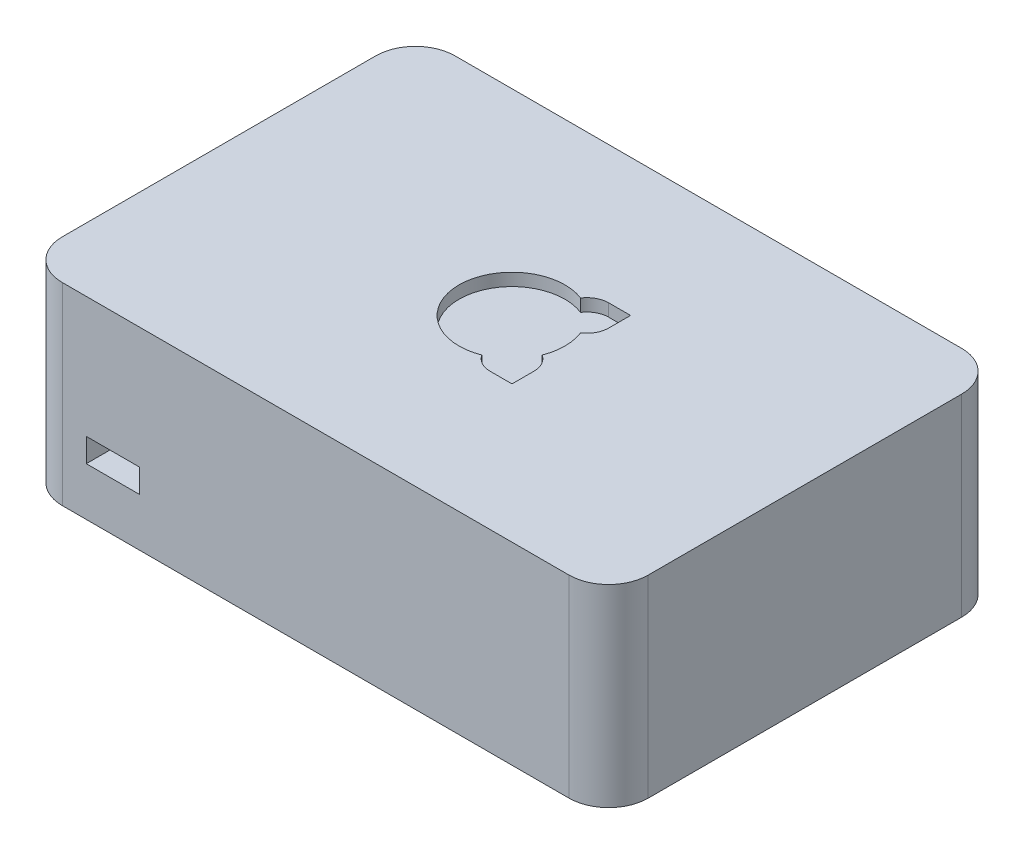
ISO-10303-21;
HEADER;
FILE_DESCRIPTION(('STEP AP214'),'2;1');
FILE_NAME('part.step','',(''),(''),'','','');
FILE_SCHEMA(('AUTOMOTIVE_DESIGN { 1 0 10303 214 1 1 1 1 }'));
ENDSEC;
DATA;
#1=APPLICATION_CONTEXT('core data for automotive mechanical design processes');
#2=APPLICATION_PROTOCOL_DEFINITION('international standard','automotive_design',2000,#1);
#3=PRODUCT_CONTEXT('',#1,'mechanical');
#4=PRODUCT('Part','Part','',(#3));
#5=PRODUCT_RELATED_PRODUCT_CATEGORY('part','',(#4));
#6=PRODUCT_DEFINITION_FORMATION('','',#4);
#7=PRODUCT_DEFINITION_CONTEXT('part definition',#1,'design');
#8=PRODUCT_DEFINITION('design','',#6,#7);
#9=PRODUCT_DEFINITION_SHAPE('','',#8);
#10=(LENGTH_UNIT() NAMED_UNIT(*) SI_UNIT(.MILLI.,.METRE.));
#11=(NAMED_UNIT(*) PLANE_ANGLE_UNIT() SI_UNIT($,.RADIAN.));
#12=(NAMED_UNIT(*) SI_UNIT($,.STERADIAN.) SOLID_ANGLE_UNIT());
#13=UNCERTAINTY_MEASURE_WITH_UNIT(LENGTH_MEASURE(1.E-05),#10,'distance_accuracy_value','');
#14=(GEOMETRIC_REPRESENTATION_CONTEXT(3) GLOBAL_UNCERTAINTY_ASSIGNED_CONTEXT((#13)) GLOBAL_UNIT_ASSIGNED_CONTEXT((#10,
#11,#12)) REPRESENTATION_CONTEXT('',''));
#15=CARTESIAN_POINT('',(0.,0.,0.));
#16=DIRECTION('',(0.,0.,1.));
#17=DIRECTION('',(1.,0.,0.));
#18=AXIS2_PLACEMENT_3D('',#15,#16,#17);
#19=CARTESIAN_POINT('',(0.,31.,-63.));
#20=DIRECTION('',(0.,0.,-1.));
#21=DIRECTION('',(-1.,0.,0.));
#22=AXIS2_PLACEMENT_3D('',#19,#20,#21);
#23=PLANE('',#22);
#24=DIRECTION('',(1.,0.,0.));
#25=VECTOR('',#24,1.);
#26=CARTESIAN_POINT('',(0.,0.,-63.));
#27=LINE('',#26,#25);
#28=CARTESIAN_POINT('',(6.35,0.,-63.));
#29=VERTEX_POINT('',#28);
#30=CARTESIAN_POINT('',(87.65,0.,-63.));
#31=VERTEX_POINT('',#30);
#32=EDGE_CURVE('E424',#29,#31,#27,.T.);
#33=ORIENTED_EDGE('',*,*,#32,.F.);
#34=DIRECTION('',(0.,-1.,0.));
#35=VECTOR('',#34,1.);
#36=CARTESIAN_POINT('',(6.35,31.,-63.));
#37=LINE('',#36,#35);
#38=CARTESIAN_POINT('',(6.35,31.,-63.));
#39=VERTEX_POINT('',#38);
#40=EDGE_CURVE('E444',#29,#39,#37,.F.);
#41=ORIENTED_EDGE('',*,*,#40,.T.);
#42=DIRECTION('',(1.,0.,0.));
#43=VECTOR('',#42,1.);
#44=CARTESIAN_POINT('',(0.,31.,-63.));
#45=LINE('',#44,#43);
#46=CARTESIAN_POINT('',(87.65,31.,-63.));
#47=VERTEX_POINT('',#46);
#48=EDGE_CURVE('E412',#39,#47,#45,.T.);
#49=ORIENTED_EDGE('',*,*,#48,.T.);
#50=DIRECTION('',(0.,-1.,0.));
#51=VECTOR('',#50,1.);
#52=CARTESIAN_POINT('',(87.65,0.,-63.));
#53=LINE('',#52,#51);
#54=EDGE_CURVE('E441',#47,#31,#53,.T.);
#55=ORIENTED_EDGE('',*,*,#54,.T.);
#56=EDGE_LOOP('',(#33,#41,#49,#55));
#57=FACE_BOUND('',#56,.T.);
#58=DIRECTION('',(1.,0.,0.));
#59=VECTOR('',#58,1.);
#60=CARTESIAN_POINT('',(12.,28.46,-63.));
#61=LINE('',#60,#59);
#62=CARTESIAN_POINT('',(12.,28.46,-63.));
#63=VERTEX_POINT('',#62);
#64=CARTESIAN_POINT('',(62.5,28.46,-63.));
#65=VERTEX_POINT('',#64);
#66=EDGE_CURVE('E389',#63,#65,#61,.T.);
#67=ORIENTED_EDGE('',*,*,#66,.F.);
#68=DIRECTION('',(0.,1.,0.));
#69=VECTOR('',#68,1.);
#70=CARTESIAN_POINT('',(12.,26.46,-63.));
#71=LINE('',#70,#69);
#72=CARTESIAN_POINT('',(12.,26.46,-63.));
#73=VERTEX_POINT('',#72);
#74=EDGE_CURVE('E370',#73,#63,#71,.T.);
#75=ORIENTED_EDGE('',*,*,#74,.F.);
#76=DIRECTION('',(-1.,0.,0.));
#77=VECTOR('',#76,1.);
#78=CARTESIAN_POINT('',(12.,26.46,-63.));
#79=LINE('',#78,#77);
#80=CARTESIAN_POINT('',(62.5,26.46,-63.));
#81=VERTEX_POINT('',#80);
#82=EDGE_CURVE('E380',#81,#73,#79,.T.);
#83=ORIENTED_EDGE('',*,*,#82,.F.);
#84=DIRECTION('',(0.,-1.,0.));
#85=VECTOR('',#84,1.);
#86=CARTESIAN_POINT('',(62.5,26.46,-63.));
#87=LINE('',#86,#85);
#88=EDGE_CURVE('E391',#65,#81,#87,.T.);
#89=ORIENTED_EDGE('',*,*,#88,.F.);
#90=EDGE_LOOP('',(#67,#75,#83,#89));
#91=FACE_BOUND('',#90,.T.);
#92=ADVANCED_FACE('F92',(#57,#91),#23,.T.);
#93=CARTESIAN_POINT('',(0.,31.,0.));
#94=DIRECTION('',(0.,0.,-1.));
#95=DIRECTION('',(-1.,0.,0.));
#96=AXIS2_PLACEMENT_3D('',#93,#94,#95);
#97=PLANE('',#96);
#98=DIRECTION('',(1.,0.,0.));
#99=VECTOR('',#98,1.);
#100=CARTESIAN_POINT('',(10.2,7.75,0.));
#101=LINE('',#100,#99);
#102=CARTESIAN_POINT('',(10.2,7.75,0.));
#103=VERTEX_POINT('',#102);
#104=CARTESIAN_POINT('',(18.7,7.75,0.));
#105=VERTEX_POINT('',#104);
#106=EDGE_CURVE('E360',#103,#105,#101,.T.);
#107=ORIENTED_EDGE('',*,*,#106,.F.);
#108=DIRECTION('',(0.,-1.,0.));
#109=VECTOR('',#108,1.);
#110=CARTESIAN_POINT('',(10.2,7.75,0.));
#111=LINE('',#110,#109);
#112=CARTESIAN_POINT('',(10.2,11.55,0.));
#113=VERTEX_POINT('',#112);
#114=EDGE_CURVE('E115',#113,#103,#111,.T.);
#115=ORIENTED_EDGE('',*,*,#114,.F.);
#116=DIRECTION('',(-1.,0.,0.));
#117=VECTOR('',#116,1.);
#118=CARTESIAN_POINT('',(10.2,11.55,0.));
#119=LINE('',#118,#117);
#120=CARTESIAN_POINT('',(18.7,11.55,0.));
#121=VERTEX_POINT('',#120);
#122=EDGE_CURVE('E349',#121,#113,#119,.T.);
#123=ORIENTED_EDGE('',*,*,#122,.F.);
#124=DIRECTION('',(0.,1.,0.));
#125=VECTOR('',#124,1.);
#126=CARTESIAN_POINT('',(18.7,7.75,0.));
#127=LINE('',#126,#125);
#128=EDGE_CURVE('E363',#105,#121,#127,.T.);
#129=ORIENTED_EDGE('',*,*,#128,.F.);
#130=EDGE_LOOP('',(#107,#115,#123,#129));
#131=FACE_BOUND('',#130,.T.);
#132=DIRECTION('',(1.,0.,0.));
#133=VECTOR('',#132,1.);
#134=CARTESIAN_POINT('',(0.,0.,0.));
#135=LINE('',#134,#133);
#136=CARTESIAN_POINT('',(6.35,0.,0.));
#137=VERTEX_POINT('',#136);
#138=CARTESIAN_POINT('',(87.65,0.,0.));
#139=VERTEX_POINT('',#138);
#140=EDGE_CURVE('E404',#137,#139,#135,.T.);
#141=ORIENTED_EDGE('',*,*,#140,.T.);
#142=DIRECTION('',(0.,-1.,0.));
#143=VECTOR('',#142,1.);
#144=CARTESIAN_POINT('',(87.65,31.,0.));
#145=LINE('',#144,#143);
#146=CARTESIAN_POINT('',(87.65,31.,0.));
#147=VERTEX_POINT('',#146);
#148=EDGE_CURVE('E12',#139,#147,#145,.F.);
#149=ORIENTED_EDGE('',*,*,#148,.T.);
#150=DIRECTION('',(1.,0.,0.));
#151=VECTOR('',#150,1.);
#152=CARTESIAN_POINT('',(0.,31.,0.));
#153=LINE('',#152,#151);
#154=CARTESIAN_POINT('',(6.35,31.,0.));
#155=VERTEX_POINT('',#154);
#156=EDGE_CURVE('E405',#155,#147,#153,.T.);
#157=ORIENTED_EDGE('',*,*,#156,.F.);
#158=DIRECTION('',(0.,-1.,0.));
#159=VECTOR('',#158,1.);
#160=CARTESIAN_POINT('',(6.35,0.,0.));
#161=LINE('',#160,#159);
#162=EDGE_CURVE('E100',#155,#137,#161,.T.);
#163=ORIENTED_EDGE('',*,*,#162,.T.);
#164=EDGE_LOOP('',(#141,#149,#157,#163));
#165=FACE_BOUND('',#164,.T.);
#166=ADVANCED_FACE('F463',(#131,#165),#97,.F.);
#167=CARTESIAN_POINT('',(94.,31.,0.));
#168=DIRECTION('',(-1.,0.,0.));
#169=DIRECTION('',(0.,0.,1.));
#170=AXIS2_PLACEMENT_3D('',#167,#168,#169);
#171=PLANE('',#170);
#172=DIRECTION('',(0.,0.,-1.));
#173=VECTOR('',#172,1.);
#174=CARTESIAN_POINT('',(94.,0.,0.));
#175=LINE('',#174,#173);
#176=CARTESIAN_POINT('',(94.,0.,-6.35));
#177=VERTEX_POINT('',#176);
#178=CARTESIAN_POINT('',(94.,0.,-56.65));
#179=VERTEX_POINT('',#178);
#180=EDGE_CURVE('E421',#177,#179,#175,.T.);
#181=ORIENTED_EDGE('',*,*,#180,.T.);
#182=DIRECTION('',(0.,-1.,0.));
#183=VECTOR('',#182,1.);
#184=CARTESIAN_POINT('',(94.,31.,-56.65));
#185=LINE('',#184,#183);
#186=CARTESIAN_POINT('',(94.,31.,-56.65));
#187=VERTEX_POINT('',#186);
#188=EDGE_CURVE('E457',#179,#187,#185,.F.);
#189=ORIENTED_EDGE('',*,*,#188,.T.);
#190=DIRECTION('',(0.,0.,-1.));
#191=VECTOR('',#190,1.);
#192=CARTESIAN_POINT('',(94.,31.,0.));
#193=LINE('',#192,#191);
#194=CARTESIAN_POINT('',(94.,31.,-6.35));
#195=VERTEX_POINT('',#194);
#196=EDGE_CURVE('E408',#195,#187,#193,.T.);
#197=ORIENTED_EDGE('',*,*,#196,.F.);
#198=DIRECTION('',(0.,-1.,0.));
#199=VECTOR('',#198,1.);
#200=CARTESIAN_POINT('',(94.,31.,-6.35));
#201=LINE('',#200,#199);
#202=EDGE_CURVE('E454',#195,#177,#201,.T.);
#203=ORIENTED_EDGE('',*,*,#202,.T.);
#204=EDGE_LOOP('',(#181,#189,#197,#203));
#205=FACE_BOUND('',#204,.T.);
#206=ADVANCED_FACE('F477',(#205),#171,.F.);
#207=CARTESIAN_POINT('',(0.,31.,0.));
#208=DIRECTION('',(-1.,0.,0.));
#209=DIRECTION('',(0.,0.,1.));
#210=AXIS2_PLACEMENT_3D('',#207,#208,#209);
#211=PLANE('',#210);
#212=DIRECTION('',(0.,0.,-1.));
#213=VECTOR('',#212,1.);
#214=CARTESIAN_POINT('',(0.,31.,0.));
#215=LINE('',#214,#213);
#216=CARTESIAN_POINT('',(0.,31.,-6.35));
#217=VERTEX_POINT('',#216);
#218=CARTESIAN_POINT('',(0.,31.,-56.65));
#219=VERTEX_POINT('',#218);
#220=EDGE_CURVE('E415',#217,#219,#215,.T.);
#221=ORIENTED_EDGE('',*,*,#220,.T.);
#222=DIRECTION('',(0.,-1.,0.));
#223=VECTOR('',#222,1.);
#224=CARTESIAN_POINT('',(0.,31.,-56.65));
#225=LINE('',#224,#223);
#226=CARTESIAN_POINT('',(0.,0.,-56.65));
#227=VERTEX_POINT('',#226);
#228=EDGE_CURVE('E430',#219,#227,#225,.T.);
#229=ORIENTED_EDGE('',*,*,#228,.T.);
#230=DIRECTION('',(0.,0.,-1.));
#231=VECTOR('',#230,1.);
#232=CARTESIAN_POINT('',(0.,0.,0.));
#233=LINE('',#232,#231);
#234=CARTESIAN_POINT('',(0.,0.,-6.35));
#235=VERTEX_POINT('',#234);
#236=EDGE_CURVE('E409',#235,#227,#233,.T.);
#237=ORIENTED_EDGE('',*,*,#236,.F.);
#238=DIRECTION('',(0.,-1.,0.));
#239=VECTOR('',#238,1.);
#240=CARTESIAN_POINT('',(0.,31.,-6.35));
#241=LINE('',#240,#239);
#242=EDGE_CURVE('E418',#235,#217,#241,.F.);
#243=ORIENTED_EDGE('',*,*,#242,.T.);
#244=EDGE_LOOP('',(#221,#229,#237,#243));
#245=FACE_BOUND('',#244,.T.);
#246=ADVANCED_FACE('F495',(#245),#211,.T.);
#247=CARTESIAN_POINT('',(0.,31.,0.));
#248=DIRECTION('',(0.,1.,0.));
#249=DIRECTION('',(0.,0.,1.));
#250=AXIS2_PLACEMENT_3D('',#247,#248,#249);
#251=PLANE('',#250);
#252=CARTESIAN_POINT('',(53.0104076400857,31.,-25.4895923599143));
#253=DIRECTION('',(0.,1.,0.));
#254=DIRECTION('',(0.,0.,1.));
#255=AXIS2_PLACEMENT_3D('',#252,#253,#254);
#256=CIRCLE('',#255,3.50000000000001);
#257=CARTESIAN_POINT('',(50.0790209156386,31.,-23.5772712907067));
#258=VERTEX_POINT('',#257);
#259=CARTESIAN_POINT('',(53.0104076400857,31.,-21.9895923599143));
#260=VERTEX_POINT('',#259);
#261=EDGE_CURVE('E332',#258,#260,#256,.T.);
#262=ORIENTED_EDGE('',*,*,#261,.F.);
#263=CARTESIAN_POINT('',(47.,31.,-31.5));
#264=DIRECTION('',(0.,1.,0.));
#265=DIRECTION('',(0.,0.,1.));
#266=AXIS2_PLACEMENT_3D('',#263,#264,#265);
#267=CIRCLE('',#266,8.5);
#268=CARTESIAN_POINT('',(50.0790209156386,31.,-39.4227287092933));
#269=VERTEX_POINT('',#268);
#270=EDGE_CURVE('E326',#269,#258,#267,.T.);
#271=ORIENTED_EDGE('',*,*,#270,.F.);
#272=CARTESIAN_POINT('',(53.0104076400857,31.,-37.5104076400857));
#273=DIRECTION('',(0.,1.,0.));
#274=DIRECTION('',(0.,0.,1.));
#275=AXIS2_PLACEMENT_3D('',#272,#273,#274);
#276=CIRCLE('',#275,3.50000000000001);
#277=CARTESIAN_POINT('',(53.0104076400857,31.,-41.0104076400857));
#278=VERTEX_POINT('',#277);
#279=EDGE_CURVE('E336',#278,#269,#276,.T.);
#280=ORIENTED_EDGE('',*,*,#279,.F.);
#281=DIRECTION('',(-1.,0.,0.));
#282=VECTOR('',#281,1.);
#283=CARTESIAN_POINT('',(0.,31.,-41.0104076400857));
#284=LINE('',#283,#282);
#285=CARTESIAN_POINT('',(56.5104076400857,31.,-41.0104076400857));
#286=VERTEX_POINT('',#285);
#287=EDGE_CURVE('E291',#286,#278,#284,.T.);
#288=ORIENTED_EDGE('',*,*,#287,.F.);
#289=DIRECTION('',(0.,0.,-1.));
#290=VECTOR('',#289,1.);
#291=CARTESIAN_POINT('',(56.5104076400857,31.,0.));
#292=LINE('',#291,#290);
#293=CARTESIAN_POINT('',(56.5104076400857,31.,-37.5104076400857));
#294=VERTEX_POINT('',#293);
#295=EDGE_CURVE('E295',#294,#286,#292,.T.);
#296=ORIENTED_EDGE('',*,*,#295,.F.);
#297=CARTESIAN_POINT('',(54.9227287092933,31.,-34.5790209156386));
#298=VERTEX_POINT('',#297);
#299=EDGE_CURVE('E271',#298,#294,#276,.T.);
#300=ORIENTED_EDGE('',*,*,#299,.F.);
#301=CARTESIAN_POINT('',(54.9227287092933,31.,-28.4209790843614));
#302=VERTEX_POINT('',#301);
#303=EDGE_CURVE('E107',#302,#298,#267,.T.);
#304=ORIENTED_EDGE('',*,*,#303,.F.);
#305=CARTESIAN_POINT('',(56.5104076400857,31.,-25.4895923599143));
#306=VERTEX_POINT('',#305);
#307=EDGE_CURVE('E287',#306,#302,#256,.T.);
#308=ORIENTED_EDGE('',*,*,#307,.F.);
#309=DIRECTION('',(0.,0.,1.));
#310=VECTOR('',#309,1.);
#311=CARTESIAN_POINT('',(56.5104076400857,31.,0.));
#312=LINE('',#311,#310);
#313=CARTESIAN_POINT('',(56.5104076400857,31.,-21.9895923599143));
#314=VERTEX_POINT('',#313);
#315=EDGE_CURVE('E310',#306,#314,#312,.T.);
#316=ORIENTED_EDGE('',*,*,#315,.T.);
#317=DIRECTION('',(-1.,0.,0.));
#318=VECTOR('',#317,1.);
#319=CARTESIAN_POINT('',(0.,31.,-21.9895923599143));
#320=LINE('',#319,#318);
#321=EDGE_CURVE('E313',#314,#260,#320,.T.);
#322=ORIENTED_EDGE('',*,*,#321,.T.);
#323=EDGE_LOOP('',(#262,#271,#280,#288,#296,#300,#304,#308,#316,#322));
#324=FACE_BOUND('',#323,.T.);
#325=ORIENTED_EDGE('',*,*,#48,.F.);
#326=CARTESIAN_POINT('',(6.35,31.,-56.65));
#327=DIRECTION('',(0.,1.,0.));
#328=DIRECTION('',(0.,0.,1.));
#329=AXIS2_PLACEMENT_3D('',#326,#327,#328);
#330=CIRCLE('',#329,6.35);
#331=EDGE_CURVE('E452',#39,#219,#330,.T.);
#332=ORIENTED_EDGE('',*,*,#331,.T.);
#333=ORIENTED_EDGE('',*,*,#220,.F.);
#334=CARTESIAN_POINT('',(6.35,31.,-6.35));
#335=DIRECTION('',(0.,1.,0.));
#336=DIRECTION('',(0.,0.,1.));
#337=AXIS2_PLACEMENT_3D('',#334,#335,#336);
#338=CIRCLE('',#337,6.35);
#339=EDGE_CURVE('E446',#217,#155,#338,.T.);
#340=ORIENTED_EDGE('',*,*,#339,.T.);
#341=ORIENTED_EDGE('',*,*,#156,.T.);
#342=CARTESIAN_POINT('',(87.65,31.,-6.35));
#343=DIRECTION('',(0.,1.,0.));
#344=DIRECTION('',(0.,0.,1.));
#345=AXIS2_PLACEMENT_3D('',#342,#343,#344);
#346=CIRCLE('',#345,6.35);
#347=EDGE_CURVE('E448',#147,#195,#346,.T.);
#348=ORIENTED_EDGE('',*,*,#347,.T.);
#349=ORIENTED_EDGE('',*,*,#196,.T.);
#350=CARTESIAN_POINT('',(87.65,31.,-56.65));
#351=DIRECTION('',(0.,1.,0.));
#352=DIRECTION('',(0.,0.,1.));
#353=AXIS2_PLACEMENT_3D('',#350,#351,#352);
#354=CIRCLE('',#353,6.35);
#355=EDGE_CURVE('E450',#187,#47,#354,.T.);
#356=ORIENTED_EDGE('',*,*,#355,.T.);
#357=EDGE_LOOP('',(#325,#332,#333,#340,#341,#348,#349,#356));
#358=FACE_BOUND('',#357,.T.);
#359=ADVANCED_FACE('F482',(#324,#358),#251,.T.);
#360=CARTESIAN_POINT('',(0.,0.,0.));
#361=DIRECTION('',(0.,1.,0.));
#362=DIRECTION('',(0.,0.,1.));
#363=AXIS2_PLACEMENT_3D('',#360,#361,#362);
#364=PLANE('',#363);
#365=CARTESIAN_POINT('',(27.2,0.,-31.5));
#366=DIRECTION('',(0.,-1.,0.));
#367=DIRECTION('',(0.,0.,-1.));
#368=AXIS2_PLACEMENT_3D('',#365,#366,#367);
#369=CIRCLE('',#368,1.5875);
#370=CARTESIAN_POINT('',(27.2,0.,-33.0875));
#371=VERTEX_POINT('',#370);
#372=EDGE_CURVE('E806',#371,#371,#369,.T.);
#373=ORIENTED_EDGE('',*,*,#372,.F.);
#374=EDGE_LOOP('',(#373));
#375=FACE_BOUND('',#374,.T.);
#376=CARTESIAN_POINT('',(79.,0.,-31.5));
#377=DIRECTION('',(0.,-1.,0.));
#378=DIRECTION('',(0.,0.,-1.));
#379=AXIS2_PLACEMENT_3D('',#376,#377,#378);
#380=CIRCLE('',#379,1.5875);
#381=CARTESIAN_POINT('',(79.,0.,-33.0875));
#382=VERTEX_POINT('',#381);
#383=EDGE_CURVE('E298',#382,#382,#380,.T.);
#384=ORIENTED_EDGE('',*,*,#383,.F.);
#385=EDGE_LOOP('',(#384));
#386=FACE_BOUND('',#385,.T.);
#387=ORIENTED_EDGE('',*,*,#236,.T.);
#388=CARTESIAN_POINT('',(6.35,0.,-56.65));
#389=DIRECTION('',(0.,1.,0.));
#390=DIRECTION('',(0.,0.,1.));
#391=AXIS2_PLACEMENT_3D('',#388,#389,#390);
#392=CIRCLE('',#391,6.35);
#393=EDGE_CURVE('E439',#227,#29,#392,.F.);
#394=ORIENTED_EDGE('',*,*,#393,.T.);
#395=ORIENTED_EDGE('',*,*,#32,.T.);
#396=CARTESIAN_POINT('',(87.65,0.,-56.65));
#397=DIRECTION('',(0.,1.,0.));
#398=DIRECTION('',(0.,0.,1.));
#399=AXIS2_PLACEMENT_3D('',#396,#397,#398);
#400=CIRCLE('',#399,6.35);
#401=EDGE_CURVE('E437',#31,#179,#400,.F.);
#402=ORIENTED_EDGE('',*,*,#401,.T.);
#403=ORIENTED_EDGE('',*,*,#180,.F.);
#404=CARTESIAN_POINT('',(87.65,0.,-6.35));
#405=DIRECTION('',(0.,1.,0.));
#406=DIRECTION('',(0.,0.,1.));
#407=AXIS2_PLACEMENT_3D('',#404,#405,#406);
#408=CIRCLE('',#407,6.35);
#409=EDGE_CURVE('E435',#177,#139,#408,.F.);
#410=ORIENTED_EDGE('',*,*,#409,.T.);
#411=ORIENTED_EDGE('',*,*,#140,.F.);
#412=CARTESIAN_POINT('',(6.35,0.,-6.35));
#413=DIRECTION('',(0.,1.,0.));
#414=DIRECTION('',(0.,0.,1.));
#415=AXIS2_PLACEMENT_3D('',#412,#413,#414);
#416=CIRCLE('',#415,6.35);
#417=EDGE_CURVE('E433',#137,#235,#416,.F.);
#418=ORIENTED_EDGE('',*,*,#417,.T.);
#419=EDGE_LOOP('',(#387,#394,#395,#402,#403,#410,#411,#418));
#420=FACE_BOUND('',#419,.T.);
#421=ADVANCED_FACE('F468',(#375,#386,#420),#364,.F.);
#422=CARTESIAN_POINT('',(6.35,31.,-56.65));
#423=DIRECTION('',(0.,-1.,0.));
#424=DIRECTION('',(0.,0.,-1.));
#425=AXIS2_PLACEMENT_3D('',#422,#423,#424);
#426=CYLINDRICAL_SURFACE('',#425,6.35);
#427=ORIENTED_EDGE('',*,*,#331,.F.);
#428=ORIENTED_EDGE('',*,*,#40,.F.);
#429=ORIENTED_EDGE('',*,*,#393,.F.);
#430=ORIENTED_EDGE('',*,*,#228,.F.);
#431=EDGE_LOOP('',(#427,#428,#429,#430));
#432=FACE_BOUND('',#431,.T.);
#433=ADVANCED_FACE('F493',(#432),#426,.T.);
#434=CARTESIAN_POINT('',(87.65,31.,-56.65));
#435=DIRECTION('',(0.,1.,0.));
#436=DIRECTION('',(0.,0.,1.));
#437=AXIS2_PLACEMENT_3D('',#434,#435,#436);
#438=CYLINDRICAL_SURFACE('',#437,6.35);
#439=ORIENTED_EDGE('',*,*,#355,.F.);
#440=ORIENTED_EDGE('',*,*,#188,.F.);
#441=ORIENTED_EDGE('',*,*,#401,.F.);
#442=ORIENTED_EDGE('',*,*,#54,.F.);
#443=EDGE_LOOP('',(#439,#440,#441,#442));
#444=FACE_BOUND('',#443,.T.);
#445=ADVANCED_FACE('F485',(#444),#438,.T.);
#446=CARTESIAN_POINT('',(87.65,31.,-6.35));
#447=DIRECTION('',(0.,-1.,0.));
#448=DIRECTION('',(0.,0.,-1.));
#449=AXIS2_PLACEMENT_3D('',#446,#447,#448);
#450=CYLINDRICAL_SURFACE('',#449,6.35);
#451=ORIENTED_EDGE('',*,*,#347,.F.);
#452=ORIENTED_EDGE('',*,*,#148,.F.);
#453=ORIENTED_EDGE('',*,*,#409,.F.);
#454=ORIENTED_EDGE('',*,*,#202,.F.);
#455=EDGE_LOOP('',(#451,#452,#453,#454));
#456=FACE_BOUND('',#455,.T.);
#457=ADVANCED_FACE('F474',(#456),#450,.T.);
#458=CARTESIAN_POINT('',(6.35,31.,-6.35));
#459=DIRECTION('',(0.,1.,0.));
#460=DIRECTION('',(0.,0.,1.));
#461=AXIS2_PLACEMENT_3D('',#458,#459,#460);
#462=CYLINDRICAL_SURFACE('',#461,6.35);
#463=ORIENTED_EDGE('',*,*,#339,.F.);
#464=ORIENTED_EDGE('',*,*,#242,.F.);
#465=ORIENTED_EDGE('',*,*,#417,.F.);
#466=ORIENTED_EDGE('',*,*,#162,.F.);
#467=EDGE_LOOP('',(#463,#464,#465,#466));
#468=FACE_BOUND('',#467,.T.);
#469=ADVANCED_FACE('F94',(#468),#462,.T.);
#470=CARTESIAN_POINT('',(12.,26.46,-65.5));
#471=DIRECTION('',(1.,0.,0.));
#472=DIRECTION('',(0.,0.,-1.));
#473=AXIS2_PLACEMENT_3D('',#470,#471,#472);
#474=PLANE('',#473);
#475=ORIENTED_EDGE('',*,*,#74,.T.);
#476=DIRECTION('',(0.,0.,1.));
#477=VECTOR('',#476,1.);
#478=CARTESIAN_POINT('',(12.,28.46,-65.5));
#479=LINE('',#478,#477);
#480=CARTESIAN_POINT('',(12.,28.46,-65.5));
#481=VERTEX_POINT('',#480);
#482=EDGE_CURVE('E402',#481,#63,#479,.T.);
#483=ORIENTED_EDGE('',*,*,#482,.F.);
#484=DIRECTION('',(0.,1.,0.));
#485=VECTOR('',#484,1.);
#486=CARTESIAN_POINT('',(12.,26.46,-65.5));
#487=LINE('',#486,#485);
#488=CARTESIAN_POINT('',(12.,26.46,-65.5));
#489=VERTEX_POINT('',#488);
#490=EDGE_CURVE('E376',#489,#481,#487,.T.);
#491=ORIENTED_EDGE('',*,*,#490,.F.);
#492=DIRECTION('',(0.,0.,1.));
#493=VECTOR('',#492,1.);
#494=CARTESIAN_POINT('',(12.,26.46,-65.5));
#495=LINE('',#494,#493);
#496=EDGE_CURVE('E386',#489,#73,#495,.T.);
#497=ORIENTED_EDGE('',*,*,#496,.T.);
#498=EDGE_LOOP('',(#475,#483,#491,#497));
#499=FACE_BOUND('',#498,.T.);
#500=ADVANCED_FACE('F499',(#499),#474,.F.);
#501=CARTESIAN_POINT('',(12.,28.46,-65.5));
#502=DIRECTION('',(0.,-1.,0.));
#503=DIRECTION('',(1.,0.,0.));
#504=AXIS2_PLACEMENT_3D('',#501,#502,#503);
#505=PLANE('',#504);
#506=ORIENTED_EDGE('',*,*,#66,.T.);
#507=DIRECTION('',(0.,0.,1.));
#508=VECTOR('',#507,1.);
#509=CARTESIAN_POINT('',(62.5,28.46,-65.5));
#510=LINE('',#509,#508);
#511=CARTESIAN_POINT('',(62.5,28.46,-65.5));
#512=VERTEX_POINT('',#511);
#513=EDGE_CURVE('E399',#512,#65,#510,.T.);
#514=ORIENTED_EDGE('',*,*,#513,.F.);
#515=DIRECTION('',(1.,0.,0.));
#516=VECTOR('',#515,1.);
#517=CARTESIAN_POINT('',(12.,28.46,-65.5));
#518=LINE('',#517,#516);
#519=EDGE_CURVE('E379',#481,#512,#518,.T.);
#520=ORIENTED_EDGE('',*,*,#519,.F.);
#521=ORIENTED_EDGE('',*,*,#482,.T.);
#522=EDGE_LOOP('',(#506,#514,#520,#521));
#523=FACE_BOUND('',#522,.T.);
#524=ADVANCED_FACE('F504',(#523),#505,.F.);
#525=CARTESIAN_POINT('',(62.5,26.46,-65.5));
#526=DIRECTION('',(-1.,0.,0.));
#527=DIRECTION('',(0.,0.,1.));
#528=AXIS2_PLACEMENT_3D('',#525,#526,#527);
#529=PLANE('',#528);
#530=ORIENTED_EDGE('',*,*,#88,.T.);
#531=DIRECTION('',(0.,0.,1.));
#532=VECTOR('',#531,1.);
#533=CARTESIAN_POINT('',(62.5,26.46,-65.5));
#534=LINE('',#533,#532);
#535=CARTESIAN_POINT('',(62.5,26.46,-65.5));
#536=VERTEX_POINT('',#535);
#537=EDGE_CURVE('E397',#536,#81,#534,.T.);
#538=ORIENTED_EDGE('',*,*,#537,.F.);
#539=DIRECTION('',(0.,-1.,0.));
#540=VECTOR('',#539,1.);
#541=CARTESIAN_POINT('',(62.5,26.46,-65.5));
#542=LINE('',#541,#540);
#543=EDGE_CURVE('E382',#512,#536,#542,.T.);
#544=ORIENTED_EDGE('',*,*,#543,.F.);
#545=ORIENTED_EDGE('',*,*,#513,.T.);
#546=EDGE_LOOP('',(#530,#538,#544,#545));
#547=FACE_BOUND('',#546,.T.);
#548=ADVANCED_FACE('F554',(#547),#529,.F.);
#549=CARTESIAN_POINT('',(12.,26.46,-65.5));
#550=DIRECTION('',(0.,1.,0.));
#551=DIRECTION('',(-1.,0.,0.));
#552=AXIS2_PLACEMENT_3D('',#549,#550,#551);
#553=PLANE('',#552);
#554=ORIENTED_EDGE('',*,*,#82,.T.);
#555=ORIENTED_EDGE('',*,*,#496,.F.);
#556=DIRECTION('',(-1.,0.,0.));
#557=VECTOR('',#556,1.);
#558=CARTESIAN_POINT('',(12.,26.46,-65.5));
#559=LINE('',#558,#557);
#560=EDGE_CURVE('E384',#536,#489,#559,.T.);
#561=ORIENTED_EDGE('',*,*,#560,.F.);
#562=ORIENTED_EDGE('',*,*,#537,.T.);
#563=EDGE_LOOP('',(#554,#555,#561,#562));
#564=FACE_BOUND('',#563,.T.);
#565=ADVANCED_FACE('F564',(#564),#553,.F.);
#566=CARTESIAN_POINT('',(0.,0.,-65.5));
#567=DIRECTION('',(0.,0.,-1.));
#568=DIRECTION('',(-1.,0.,0.));
#569=AXIS2_PLACEMENT_3D('',#566,#567,#568);
#570=PLANE('',#569);
#571=ORIENTED_EDGE('',*,*,#490,.T.);
#572=ORIENTED_EDGE('',*,*,#519,.T.);
#573=ORIENTED_EDGE('',*,*,#543,.T.);
#574=ORIENTED_EDGE('',*,*,#560,.T.);
#575=EDGE_LOOP('',(#571,#572,#573,#574));
#576=FACE_BOUND('',#575,.T.);
#577=ADVANCED_FACE('F574',(#576),#570,.T.);
#578=CARTESIAN_POINT('',(10.2,7.75,-8.));
#579=DIRECTION('',(-1.,0.,0.));
#580=DIRECTION('',(0.,0.,1.));
#581=AXIS2_PLACEMENT_3D('',#578,#579,#580);
#582=PLANE('',#581);
#583=ORIENTED_EDGE('',*,*,#114,.T.);
#584=DIRECTION('',(0.,0.,1.));
#585=VECTOR('',#584,1.);
#586=CARTESIAN_POINT('',(10.2,7.75,-8.));
#587=LINE('',#586,#585);
#588=CARTESIAN_POINT('',(10.2,7.75,-8.));
#589=VERTEX_POINT('',#588);
#590=EDGE_CURVE('E358',#589,#103,#587,.T.);
#591=ORIENTED_EDGE('',*,*,#590,.F.);
#592=DIRECTION('',(0.,-1.,0.));
#593=VECTOR('',#592,1.);
#594=CARTESIAN_POINT('',(10.2,7.75,-8.));
#595=LINE('',#594,#593);
#596=CARTESIAN_POINT('',(10.2,11.55,-8.));
#597=VERTEX_POINT('',#596);
#598=EDGE_CURVE('E345',#597,#589,#595,.T.);
#599=ORIENTED_EDGE('',*,*,#598,.F.);
#600=DIRECTION('',(0.,0.,1.));
#601=VECTOR('',#600,1.);
#602=CARTESIAN_POINT('',(10.2,11.55,-8.));
#603=LINE('',#602,#601);
#604=EDGE_CURVE('E368',#597,#113,#603,.T.);
#605=ORIENTED_EDGE('',*,*,#604,.T.);
#606=EDGE_LOOP('',(#583,#591,#599,#605));
#607=FACE_BOUND('',#606,.T.);
#608=ADVANCED_FACE('F584',(#607),#582,.F.);
#609=CARTESIAN_POINT('',(10.2,11.55,-8.));
#610=DIRECTION('',(0.,1.,0.));
#611=DIRECTION('',(-1.,0.,0.));
#612=AXIS2_PLACEMENT_3D('',#609,#610,#611);
#613=PLANE('',#612);
#614=ORIENTED_EDGE('',*,*,#122,.T.);
#615=ORIENTED_EDGE('',*,*,#604,.F.);
#616=DIRECTION('',(-1.,0.,0.));
#617=VECTOR('',#616,1.);
#618=CARTESIAN_POINT('',(10.2,11.55,-8.));
#619=LINE('',#618,#617);
#620=CARTESIAN_POINT('',(18.7,11.55,-8.));
#621=VERTEX_POINT('',#620);
#622=EDGE_CURVE('E355',#621,#597,#619,.T.);
#623=ORIENTED_EDGE('',*,*,#622,.F.);
#624=DIRECTION('',(0.,0.,1.));
#625=VECTOR('',#624,1.);
#626=CARTESIAN_POINT('',(18.7,11.55,-8.));
#627=LINE('',#626,#625);
#628=EDGE_CURVE('E371',#621,#121,#627,.T.);
#629=ORIENTED_EDGE('',*,*,#628,.T.);
#630=EDGE_LOOP('',(#614,#615,#623,#629));
#631=FACE_BOUND('',#630,.T.);
#632=ADVANCED_FACE('F601',(#631),#613,.F.);
#633=CARTESIAN_POINT('',(18.7,7.75,-8.));
#634=DIRECTION('',(1.,0.,0.));
#635=DIRECTION('',(0.,1.,0.));
#636=AXIS2_PLACEMENT_3D('',#633,#634,#635);
#637=PLANE('',#636);
#638=ORIENTED_EDGE('',*,*,#128,.T.);
#639=ORIENTED_EDGE('',*,*,#628,.F.);
#640=DIRECTION('',(0.,1.,0.));
#641=VECTOR('',#640,1.);
#642=CARTESIAN_POINT('',(18.7,7.75,-8.));
#643=LINE('',#642,#641);
#644=CARTESIAN_POINT('',(18.7,7.75,-8.));
#645=VERTEX_POINT('',#644);
#646=EDGE_CURVE('E352',#645,#621,#643,.T.);
#647=ORIENTED_EDGE('',*,*,#646,.F.);
#648=DIRECTION('',(0.,0.,1.));
#649=VECTOR('',#648,1.);
#650=CARTESIAN_POINT('',(18.7,7.75,-8.));
#651=LINE('',#650,#649);
#652=EDGE_CURVE('E373',#645,#105,#651,.T.);
#653=ORIENTED_EDGE('',*,*,#652,.T.);
#654=EDGE_LOOP('',(#638,#639,#647,#653));
#655=FACE_BOUND('',#654,.T.);
#656=ADVANCED_FACE('F610',(#655),#637,.F.);
#657=CARTESIAN_POINT('',(10.2,7.75,-8.));
#658=DIRECTION('',(0.,-1.,0.));
#659=DIRECTION('',(1.,0.,0.));
#660=AXIS2_PLACEMENT_3D('',#657,#658,#659);
#661=PLANE('',#660);
#662=ORIENTED_EDGE('',*,*,#106,.T.);
#663=ORIENTED_EDGE('',*,*,#652,.F.);
#664=DIRECTION('',(1.,0.,0.));
#665=VECTOR('',#664,1.);
#666=CARTESIAN_POINT('',(10.2,7.75,-8.));
#667=LINE('',#666,#665);
#668=EDGE_CURVE('E348',#589,#645,#667,.T.);
#669=ORIENTED_EDGE('',*,*,#668,.F.);
#670=ORIENTED_EDGE('',*,*,#590,.T.);
#671=EDGE_LOOP('',(#662,#663,#669,#670));
#672=FACE_BOUND('',#671,.T.);
#673=ADVANCED_FACE('F620',(#672),#661,.F.);
#674=CARTESIAN_POINT('',(0.,0.,-8.));
#675=DIRECTION('',(0.,0.,-1.));
#676=DIRECTION('',(-1.,0.,0.));
#677=AXIS2_PLACEMENT_3D('',#674,#675,#676);
#678=PLANE('',#677);
#679=ORIENTED_EDGE('',*,*,#598,.T.);
#680=ORIENTED_EDGE('',*,*,#668,.T.);
#681=ORIENTED_EDGE('',*,*,#646,.T.);
#682=ORIENTED_EDGE('',*,*,#622,.T.);
#683=EDGE_LOOP('',(#679,#680,#681,#682));
#684=FACE_BOUND('',#683,.T.);
#685=ADVANCED_FACE('F630',(#684),#678,.F.);
#686=CARTESIAN_POINT('',(0.,29.,-41.0104076400857));
#687=DIRECTION('',(0.,0.,-1.));
#688=DIRECTION('',(-1.,0.,0.));
#689=AXIS2_PLACEMENT_3D('',#686,#687,#688);
#690=PLANE('',#689);
#691=ORIENTED_EDGE('',*,*,#287,.T.);
#692=DIRECTION('',(0.,1.,0.));
#693=VECTOR('',#692,1.);
#694=CARTESIAN_POINT('',(53.0104076400857,29.,-41.0104076400857));
#695=LINE('',#694,#693);
#696=CARTESIAN_POINT('',(53.0104076400857,29.,-41.0104076400857));
#697=VERTEX_POINT('',#696);
#698=EDGE_CURVE('E303',#697,#278,#695,.T.);
#699=ORIENTED_EDGE('',*,*,#698,.F.);
#700=DIRECTION('',(-1.,0.,0.));
#701=VECTOR('',#700,1.);
#702=CARTESIAN_POINT('',(0.,29.,-41.0104076400857));
#703=LINE('',#702,#701);
#704=CARTESIAN_POINT('',(56.5104076400857,29.,-41.0104076400857));
#705=VERTEX_POINT('',#704);
#706=EDGE_CURVE('E277',#705,#697,#703,.T.);
#707=ORIENTED_EDGE('',*,*,#706,.F.);
#708=DIRECTION('',(0.,1.,0.));
#709=VECTOR('',#708,1.);
#710=CARTESIAN_POINT('',(56.5104076400857,29.,-41.0104076400857));
#711=LINE('',#710,#709);
#712=EDGE_CURVE('E276',#705,#286,#711,.T.);
#713=ORIENTED_EDGE('',*,*,#712,.T.);
#714=EDGE_LOOP('',(#691,#699,#707,#713));
#715=FACE_BOUND('',#714,.T.);
#716=ADVANCED_FACE('F640',(#715),#690,.F.);
#717=CARTESIAN_POINT('',(56.5104076400857,29.,0.));
#718=DIRECTION('',(1.,0.,0.));
#719=DIRECTION('',(0.,0.,-1.));
#720=AXIS2_PLACEMENT_3D('',#717,#718,#719);
#721=PLANE('',#720);
#722=ORIENTED_EDGE('',*,*,#295,.T.);
#723=ORIENTED_EDGE('',*,*,#712,.F.);
#724=DIRECTION('',(0.,0.,-1.));
#725=VECTOR('',#724,1.);
#726=CARTESIAN_POINT('',(56.5104076400857,29.,0.));
#727=LINE('',#726,#725);
#728=CARTESIAN_POINT('',(56.5104076400857,29.,-37.5104076400857));
#729=VERTEX_POINT('',#728);
#730=EDGE_CURVE('E283',#729,#705,#727,.T.);
#731=ORIENTED_EDGE('',*,*,#730,.F.);
#732=DIRECTION('',(0.,1.,0.));
#733=VECTOR('',#732,1.);
#734=CARTESIAN_POINT('',(56.5104076400857,29.,-37.5104076400857));
#735=LINE('',#734,#733);
#736=EDGE_CURVE('E265',#729,#294,#735,.T.);
#737=ORIENTED_EDGE('',*,*,#736,.T.);
#738=EDGE_LOOP('',(#722,#723,#731,#737));
#739=FACE_BOUND('',#738,.T.);
#740=ADVANCED_FACE('F290',(#739),#721,.F.);
#741=CARTESIAN_POINT('',(0.,29.,0.));
#742=DIRECTION('',(0.,1.,0.));
#743=DIRECTION('',(0.,0.,1.));
#744=AXIS2_PLACEMENT_3D('',#741,#742,#743);
#745=PLANE('',#744);
#746=ORIENTED_EDGE('',*,*,#730,.T.);
#747=ORIENTED_EDGE('',*,*,#706,.T.);
#748=CARTESIAN_POINT('',(53.0104076400857,29.,-37.5104076400857));
#749=DIRECTION('',(0.,1.,0.));
#750=DIRECTION('',(0.,0.,1.));
#751=AXIS2_PLACEMENT_3D('',#748,#749,#750);
#752=CIRCLE('',#751,3.50000000000001);
#753=CARTESIAN_POINT('',(50.0790209156386,29.,-39.4227287092933));
#754=VERTEX_POINT('',#753);
#755=EDGE_CURVE('E288',#697,#754,#752,.T.);
#756=ORIENTED_EDGE('',*,*,#755,.T.);
#757=CARTESIAN_POINT('',(47.,29.,-31.5));
#758=DIRECTION('',(0.,1.,0.));
#759=DIRECTION('',(0.,0.,1.));
#760=AXIS2_PLACEMENT_3D('',#757,#758,#759);
#761=CIRCLE('',#760,8.5);
#762=CARTESIAN_POINT('',(50.0790209156386,29.,-23.5772712907067));
#763=VERTEX_POINT('',#762);
#764=EDGE_CURVE('E323',#754,#763,#761,.T.);
#765=ORIENTED_EDGE('',*,*,#764,.T.);
#766=CARTESIAN_POINT('',(53.0104076400857,29.,-25.4895923599143));
#767=DIRECTION('',(0.,1.,0.));
#768=DIRECTION('',(0.,0.,1.));
#769=AXIS2_PLACEMENT_3D('',#766,#767,#768);
#770=CIRCLE('',#769,3.50000000000001);
#771=CARTESIAN_POINT('',(53.0104076400857,29.,-21.9895923599143));
#772=VERTEX_POINT('',#771);
#773=EDGE_CURVE('E329',#763,#772,#770,.T.);
#774=ORIENTED_EDGE('',*,*,#773,.T.);
#775=DIRECTION('',(-1.,0.,0.));
#776=VECTOR('',#775,1.);
#777=CARTESIAN_POINT('',(0.,29.,-21.9895923599143));
#778=LINE('',#777,#776);
#779=CARTESIAN_POINT('',(56.5104076400857,29.,-21.9895923599143));
#780=VERTEX_POINT('',#779);
#781=EDGE_CURVE('E306',#780,#772,#778,.T.);
#782=ORIENTED_EDGE('',*,*,#781,.F.);
#783=DIRECTION('',(0.,0.,1.));
#784=VECTOR('',#783,1.);
#785=CARTESIAN_POINT('',(56.5104076400857,29.,0.));
#786=LINE('',#785,#784);
#787=CARTESIAN_POINT('',(56.5104076400857,29.,-25.4895923599143));
#788=VERTEX_POINT('',#787);
#789=EDGE_CURVE('E309',#788,#780,#786,.T.);
#790=ORIENTED_EDGE('',*,*,#789,.F.);
#791=CARTESIAN_POINT('',(54.9227287092933,29.,-28.4209790843614));
#792=VERTEX_POINT('',#791);
#793=EDGE_CURVE('E330',#788,#792,#770,.T.);
#794=ORIENTED_EDGE('',*,*,#793,.T.);
#795=CARTESIAN_POINT('',(54.9227287092933,29.,-34.5790209156386));
#796=VERTEX_POINT('',#795);
#797=EDGE_CURVE('E286',#792,#796,#761,.T.);
#798=ORIENTED_EDGE('',*,*,#797,.T.);
#799=EDGE_CURVE('E268',#796,#729,#752,.T.);
#800=ORIENTED_EDGE('',*,*,#799,.T.);
#801=EDGE_LOOP('',(#746,#747,#756,#765,#774,#782,#790,#794,#798,#800));
#802=FACE_BOUND('',#801,.T.);
#803=ADVANCED_FACE('F281',(#802),#745,.T.);
#804=CARTESIAN_POINT('',(0.,29.,-21.9895923599143));
#805=DIRECTION('',(0.,0.,-1.));
#806=DIRECTION('',(-1.,0.,0.));
#807=AXIS2_PLACEMENT_3D('',#804,#805,#806);
#808=PLANE('',#807);
#809=ORIENTED_EDGE('',*,*,#321,.F.);
#810=DIRECTION('',(0.,1.,0.));
#811=VECTOR('',#810,1.);
#812=CARTESIAN_POINT('',(56.5104076400857,29.,-21.9895923599143));
#813=LINE('',#812,#811);
#814=EDGE_CURVE('E320',#780,#314,#813,.T.);
#815=ORIENTED_EDGE('',*,*,#814,.F.);
#816=ORIENTED_EDGE('',*,*,#781,.T.);
#817=DIRECTION('',(0.,1.,0.));
#818=VECTOR('',#817,1.);
#819=CARTESIAN_POINT('',(53.0104076400857,29.,-21.9895923599143));
#820=LINE('',#819,#818);
#821=EDGE_CURVE('E312',#772,#260,#820,.T.);
#822=ORIENTED_EDGE('',*,*,#821,.T.);
#823=EDGE_LOOP('',(#809,#815,#816,#822));
#824=FACE_BOUND('',#823,.T.);
#825=ADVANCED_FACE('F665',(#824),#808,.T.);
#826=CARTESIAN_POINT('',(56.5104076400857,29.,0.));
#827=DIRECTION('',(-1.,0.,0.));
#828=DIRECTION('',(0.,0.,1.));
#829=AXIS2_PLACEMENT_3D('',#826,#827,#828);
#830=PLANE('',#829);
#831=ORIENTED_EDGE('',*,*,#315,.F.);
#832=DIRECTION('',(0.,1.,0.));
#833=VECTOR('',#832,1.);
#834=CARTESIAN_POINT('',(56.5104076400857,29.,-25.4895923599143));
#835=LINE('',#834,#833);
#836=EDGE_CURVE('E301',#788,#306,#835,.T.);
#837=ORIENTED_EDGE('',*,*,#836,.F.);
#838=ORIENTED_EDGE('',*,*,#789,.T.);
#839=ORIENTED_EDGE('',*,*,#814,.T.);
#840=EDGE_LOOP('',(#831,#837,#838,#839));
#841=FACE_BOUND('',#840,.T.);
#842=ADVANCED_FACE('F690',(#841),#830,.T.);
#843=CARTESIAN_POINT('',(53.0104076400857,29.,-25.4895923599143));
#844=DIRECTION('',(0.,1.,0.));
#845=DIRECTION('',(0.,0.,1.));
#846=AXIS2_PLACEMENT_3D('',#843,#844,#845);
#847=CYLINDRICAL_SURFACE('',#846,3.50000000000001);
#848=ORIENTED_EDGE('',*,*,#773,.F.);
#849=DIRECTION('',(0.,1.,0.));
#850=VECTOR('',#849,1.);
#851=CARTESIAN_POINT('',(50.0790209156386,30.,-23.5772712907067));
#852=LINE('',#851,#850);
#853=EDGE_CURVE('E342',#258,#763,#852,.F.);
#854=ORIENTED_EDGE('',*,*,#853,.F.);
#855=ORIENTED_EDGE('',*,*,#261,.T.);
#856=ORIENTED_EDGE('',*,*,#821,.F.);
#857=EDGE_LOOP('',(#848,#854,#855,#856));
#858=FACE_BOUND('',#857,.T.);
#859=ADVANCED_FACE('F700',(#858),#847,.F.);
#860=ORIENTED_EDGE('',*,*,#836,.T.);
#861=ORIENTED_EDGE('',*,*,#307,.T.);
#862=DIRECTION('',(0.,1.,0.));
#863=VECTOR('',#862,1.);
#864=CARTESIAN_POINT('',(54.9227287092933,30.,-28.4209790843614));
#865=LINE('',#864,#863);
#866=EDGE_CURVE('E316',#792,#302,#865,.T.);
#867=ORIENTED_EDGE('',*,*,#866,.F.);
#868=ORIENTED_EDGE('',*,*,#793,.F.);
#869=EDGE_LOOP('',(#860,#861,#867,#868));
#870=FACE_BOUND('',#869,.T.);
#871=ADVANCED_FACE('F710',(#870),#847,.F.);
#872=CARTESIAN_POINT('',(47.,29.,-31.5));
#873=DIRECTION('',(0.,1.,0.));
#874=DIRECTION('',(0.,0.,1.));
#875=AXIS2_PLACEMENT_3D('',#872,#873,#874);
#876=CYLINDRICAL_SURFACE('',#875,8.5);
#877=ORIENTED_EDGE('',*,*,#853,.T.);
#878=ORIENTED_EDGE('',*,*,#764,.F.);
#879=DIRECTION('',(0.,1.,0.));
#880=VECTOR('',#879,1.);
#881=CARTESIAN_POINT('',(50.0790209156386,30.,-39.4227287092933));
#882=LINE('',#881,#880);
#883=EDGE_CURVE('E339',#754,#269,#882,.T.);
#884=ORIENTED_EDGE('',*,*,#883,.T.);
#885=ORIENTED_EDGE('',*,*,#270,.T.);
#886=EDGE_LOOP('',(#877,#878,#884,#885));
#887=FACE_BOUND('',#886,.T.);
#888=ADVANCED_FACE('F720',(#887),#876,.F.);
#889=ORIENTED_EDGE('',*,*,#866,.T.);
#890=ORIENTED_EDGE('',*,*,#303,.T.);
#891=DIRECTION('',(0.,1.,0.));
#892=VECTOR('',#891,1.);
#893=CARTESIAN_POINT('',(54.9227287092933,30.,-34.5790209156386));
#894=LINE('',#893,#892);
#895=EDGE_CURVE('E337',#298,#796,#894,.F.);
#896=ORIENTED_EDGE('',*,*,#895,.T.);
#897=ORIENTED_EDGE('',*,*,#797,.F.);
#898=EDGE_LOOP('',(#889,#890,#896,#897));
#899=FACE_BOUND('',#898,.T.);
#900=ADVANCED_FACE('F729',(#899),#876,.F.);
#901=CARTESIAN_POINT('',(53.0104076400857,29.,-37.5104076400857));
#902=DIRECTION('',(0.,1.,0.));
#903=DIRECTION('',(0.,0.,1.));
#904=AXIS2_PLACEMENT_3D('',#901,#902,#903);
#905=CYLINDRICAL_SURFACE('',#904,3.50000000000001);
#906=ORIENTED_EDGE('',*,*,#698,.T.);
#907=ORIENTED_EDGE('',*,*,#279,.T.);
#908=ORIENTED_EDGE('',*,*,#883,.F.);
#909=ORIENTED_EDGE('',*,*,#755,.F.);
#910=EDGE_LOOP('',(#906,#907,#908,#909));
#911=FACE_BOUND('',#910,.T.);
#912=ADVANCED_FACE('F643',(#911),#905,.F.);
#913=ORIENTED_EDGE('',*,*,#799,.F.);
#914=ORIENTED_EDGE('',*,*,#895,.F.);
#915=ORIENTED_EDGE('',*,*,#299,.T.);
#916=ORIENTED_EDGE('',*,*,#736,.F.);
#917=EDGE_LOOP('',(#913,#914,#915,#916));
#918=FACE_BOUND('',#917,.T.);
#919=ADVANCED_FACE('F267',(#918),#905,.F.);
#920=CARTESIAN_POINT('',(79.,5.,-31.5));
#921=DIRECTION('',(0.,-1.,0.));
#922=DIRECTION('',(0.,0.,-1.));
#923=AXIS2_PLACEMENT_3D('',#920,#921,#922);
#924=CYLINDRICAL_SURFACE('',#923,1.5875);
#925=CARTESIAN_POINT('',(79.,5.,-31.5));
#926=DIRECTION('',(0.,-1.,0.));
#927=DIRECTION('',(0.,0.,-1.));
#928=AXIS2_PLACEMENT_3D('',#925,#926,#927);
#929=CIRCLE('',#928,1.5875);
#930=CARTESIAN_POINT('',(79.,5.,-33.0875));
#931=VERTEX_POINT('',#930);
#932=EDGE_CURVE('E809',#931,#931,#929,.T.);
#933=ORIENTED_EDGE('',*,*,#932,.F.);
#934=EDGE_LOOP('',(#933));
#935=FACE_BOUND('',#934,.T.);
#936=ORIENTED_EDGE('',*,*,#383,.T.);
#937=EDGE_LOOP('',(#936));
#938=FACE_BOUND('',#937,.T.);
#939=ADVANCED_FACE('F682',(#935,#938),#924,.F.);
#940=CARTESIAN_POINT('',(79.,5.,-31.5));
#941=DIRECTION('',(0.,-1.,0.));
#942=DIRECTION('',(0.,0.,-1.));
#943=AXIS2_PLACEMENT_3D('',#940,#941,#942);
#944=PLANE('',#943);
#945=ORIENTED_EDGE('',*,*,#932,.T.);
#946=EDGE_LOOP('',(#945));
#947=FACE_BOUND('',#946,.T.);
#948=ADVANCED_FACE('F769',(#947),#944,.T.);
#949=CARTESIAN_POINT('',(27.2,5.,-31.5));
#950=DIRECTION('',(0.,-1.,0.));
#951=DIRECTION('',(0.,0.,-1.));
#952=AXIS2_PLACEMENT_3D('',#949,#950,#951);
#953=CYLINDRICAL_SURFACE('',#952,1.5875);
#954=CARTESIAN_POINT('',(27.2,5.,-31.5));
#955=DIRECTION('',(0.,-1.,0.));
#956=DIRECTION('',(0.,0.,-1.));
#957=AXIS2_PLACEMENT_3D('',#954,#955,#956);
#958=CIRCLE('',#957,1.5875);
#959=CARTESIAN_POINT('',(27.2,5.,-33.0875));
#960=VERTEX_POINT('',#959);
#961=EDGE_CURVE('E805',#960,#960,#958,.T.);
#962=ORIENTED_EDGE('',*,*,#961,.F.);
#963=EDGE_LOOP('',(#962));
#964=FACE_BOUND('',#963,.T.);
#965=ORIENTED_EDGE('',*,*,#372,.T.);
#966=EDGE_LOOP('',(#965));
#967=FACE_BOUND('',#966,.T.);
#968=ADVANCED_FACE('F779',(#964,#967),#953,.F.);
#969=CARTESIAN_POINT('',(27.2,5.,-31.5));
#970=DIRECTION('',(0.,-1.,0.));
#971=DIRECTION('',(0.,0.,-1.));
#972=AXIS2_PLACEMENT_3D('',#969,#970,#971);
#973=PLANE('',#972);
#974=ORIENTED_EDGE('',*,*,#961,.T.);
#975=EDGE_LOOP('',(#974));
#976=FACE_BOUND('',#975,.T.);
#977=ADVANCED_FACE('F789',(#976),#973,.T.);
#978=CLOSED_SHELL('',(#92,#166,#206,#246,#359,#421,#433,#445,#457,#469,#500,#524,#548,#565,#577,
#608,#632,#656,#673,#685,#716,#740,#803,#825,#842,#859,#871,#888,#900,#912,#919,#939,#948,#968,#977));
#979=MANIFOLD_SOLID_BREP('B2',#978);
#980=ADVANCED_BREP_SHAPE_REPRESENTATION('',(#18,#979),#14);
#981=SHAPE_DEFINITION_REPRESENTATION(#9,#980);
ENDSEC;
END-ISO-10303-21;
